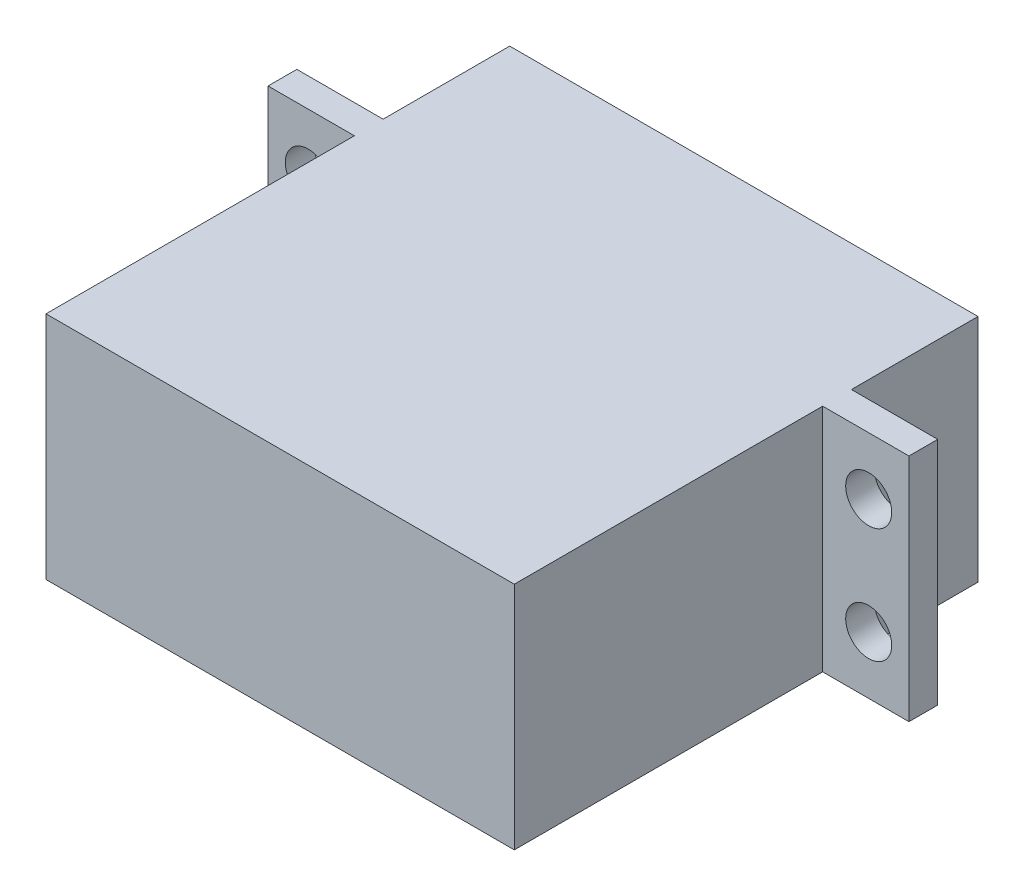
ISO-10303-21;
HEADER;
FILE_DESCRIPTION(('STEP AP214'),'2;1');
FILE_NAME('part.step','',(''),(''),'','','');
FILE_SCHEMA(('AUTOMOTIVE_DESIGN { 1 0 10303 214 1 1 1 1 }'));
ENDSEC;
DATA;
#1=APPLICATION_CONTEXT('core data for automotive mechanical design processes');
#2=APPLICATION_PROTOCOL_DEFINITION('international standard','automotive_design',2000,#1);
#3=PRODUCT_CONTEXT('',#1,'mechanical');
#4=PRODUCT('Part','Part','',(#3));
#5=PRODUCT_RELATED_PRODUCT_CATEGORY('part','',(#4));
#6=PRODUCT_DEFINITION_FORMATION('','',#4);
#7=PRODUCT_DEFINITION_CONTEXT('part definition',#1,'design');
#8=PRODUCT_DEFINITION('design','',#6,#7);
#9=PRODUCT_DEFINITION_SHAPE('','',#8);
#10=(LENGTH_UNIT() NAMED_UNIT(*) SI_UNIT(.MILLI.,.METRE.));
#11=(NAMED_UNIT(*) PLANE_ANGLE_UNIT() SI_UNIT($,.RADIAN.));
#12=(NAMED_UNIT(*) SI_UNIT($,.STERADIAN.) SOLID_ANGLE_UNIT());
#13=UNCERTAINTY_MEASURE_WITH_UNIT(LENGTH_MEASURE(1.E-05),#10,'distance_accuracy_value','');
#14=(GEOMETRIC_REPRESENTATION_CONTEXT(3) GLOBAL_UNCERTAINTY_ASSIGNED_CONTEXT((#13)) GLOBAL_UNIT_ASSIGNED_CONTEXT((#10,
#11,#12)) REPRESENTATION_CONTEXT('',''));
#15=CARTESIAN_POINT('',(0.,0.,0.));
#16=DIRECTION('',(0.,0.,1.));
#17=DIRECTION('',(1.,0.,0.));
#18=AXIS2_PLACEMENT_3D('',#15,#16,#17);
#19=CARTESIAN_POINT('',(0.,0.,0.));
#20=DIRECTION('',(0.,0.,-1.));
#21=DIRECTION('',(-1.,0.,0.));
#22=AXIS2_PLACEMENT_3D('',#19,#20,#21);
#23=PLANE('',#22);
#24=DIRECTION('',(0.,1.,0.));
#25=VECTOR('',#24,1.);
#26=CARTESIAN_POINT('',(20.35,-10.,0.));
#27=LINE('',#26,#25);
#28=CARTESIAN_POINT('',(20.35,-10.,0.));
#29=VERTEX_POINT('',#28);
#30=CARTESIAN_POINT('',(20.35,10.,0.));
#31=VERTEX_POINT('',#30);
#32=EDGE_CURVE('E207',#29,#31,#27,.T.);
#33=ORIENTED_EDGE('',*,*,#32,.F.);
#34=DIRECTION('',(1.,0.,0.));
#35=VECTOR('',#34,1.);
#36=CARTESIAN_POINT('',(-20.35,-10.,0.));
#37=LINE('',#36,#35);
#38=CARTESIAN_POINT('',(-20.35,-10.,0.));
#39=VERTEX_POINT('',#38);
#40=EDGE_CURVE('E244',#39,#29,#37,.T.);
#41=ORIENTED_EDGE('',*,*,#40,.F.);
#42=DIRECTION('',(0.,-1.,0.));
#43=VECTOR('',#42,1.);
#44=CARTESIAN_POINT('',(-20.35,-10.,0.));
#45=LINE('',#44,#43);
#46=CARTESIAN_POINT('',(-20.35,10.,0.));
#47=VERTEX_POINT('',#46);
#48=EDGE_CURVE('E130',#47,#39,#45,.T.);
#49=ORIENTED_EDGE('',*,*,#48,.F.);
#50=DIRECTION('',(-1.,0.,0.));
#51=VECTOR('',#50,1.);
#52=CARTESIAN_POINT('',(-20.35,10.,0.));
#53=LINE('',#52,#51);
#54=EDGE_CURVE('E237',#31,#47,#53,.T.);
#55=ORIENTED_EDGE('',*,*,#54,.F.);
#56=EDGE_LOOP('',(#33,#41,#49,#55));
#57=FACE_BOUND('',#56,.T.);
#58=CARTESIAN_POINT('',(10.35,0.,0.));
#59=DIRECTION('',(0.,0.,-1.));
#60=DIRECTION('',(-1.,0.,0.));
#61=AXIS2_PLACEMENT_3D('',#58,#59,#60);
#62=CIRCLE('',#61,3.);
#63=CARTESIAN_POINT('',(7.34999999999999,0.,0.));
#64=VERTEX_POINT('',#63);
#65=EDGE_CURVE('E484',#64,#64,#62,.T.);
#66=ORIENTED_EDGE('',*,*,#65,.F.);
#67=EDGE_LOOP('',(#66));
#68=FACE_BOUND('',#67,.T.);
#69=ADVANCED_FACE('F36',(#57,#68),#23,.T.);
#70=CARTESIAN_POINT('',(-20.35,-10.,40.3));
#71=DIRECTION('',(1.,0.,0.));
#72=DIRECTION('',(0.,0.,-1.));
#73=AXIS2_PLACEMENT_3D('',#70,#71,#72);
#74=PLANE('',#73);
#75=DIRECTION('',(0.,-1.,0.));
#76=VECTOR('',#75,1.);
#77=CARTESIAN_POINT('',(-20.35,0.,11.));
#78=LINE('',#77,#76);
#79=CARTESIAN_POINT('',(-20.35,10.,11.));
#80=VERTEX_POINT('',#79);
#81=CARTESIAN_POINT('',(-20.35,-10.,11.));
#82=VERTEX_POINT('',#81);
#83=EDGE_CURVE('E53',#80,#82,#78,.T.);
#84=ORIENTED_EDGE('',*,*,#83,.F.);
#85=DIRECTION('',(0.,0.,-1.));
#86=VECTOR('',#85,1.);
#87=CARTESIAN_POINT('',(-20.35,10.,40.3));
#88=LINE('',#87,#86);
#89=EDGE_CURVE('E221',#80,#47,#88,.T.);
#90=ORIENTED_EDGE('',*,*,#89,.T.);
#91=ORIENTED_EDGE('',*,*,#48,.T.);
#92=DIRECTION('',(0.,0.,-1.));
#93=VECTOR('',#92,1.);
#94=CARTESIAN_POINT('',(-20.35,-10.,40.3));
#95=LINE('',#94,#93);
#96=EDGE_CURVE('E126',#82,#39,#95,.T.);
#97=ORIENTED_EDGE('',*,*,#96,.F.);
#98=EDGE_LOOP('',(#84,#90,#91,#97));
#99=FACE_BOUND('',#98,.T.);
#100=ADVANCED_FACE('F128',(#99),#74,.F.);
#101=CARTESIAN_POINT('',(20.35,-10.,40.3));
#102=DIRECTION('',(-1.,0.,0.));
#103=DIRECTION('',(0.,0.,1.));
#104=AXIS2_PLACEMENT_3D('',#101,#102,#103);
#105=PLANE('',#104);
#106=DIRECTION('',(0.,-1.,0.));
#107=VECTOR('',#106,1.);
#108=CARTESIAN_POINT('',(20.35,0.,13.5));
#109=LINE('',#108,#107);
#110=CARTESIAN_POINT('',(20.35,10.,13.5));
#111=VERTEX_POINT('',#110);
#112=CARTESIAN_POINT('',(20.35,-10.,13.5));
#113=VERTEX_POINT('',#112);
#114=EDGE_CURVE('E190',#111,#113,#109,.T.);
#115=ORIENTED_EDGE('',*,*,#114,.F.);
#116=DIRECTION('',(0.,0.,-1.));
#117=VECTOR('',#116,1.);
#118=CARTESIAN_POINT('',(20.35,10.,40.3));
#119=LINE('',#118,#117);
#120=CARTESIAN_POINT('',(20.35,10.,40.3));
#121=VERTEX_POINT('',#120);
#122=EDGE_CURVE('E11',#121,#111,#119,.T.);
#123=ORIENTED_EDGE('',*,*,#122,.F.);
#124=DIRECTION('',(0.,1.,0.));
#125=VECTOR('',#124,1.);
#126=CARTESIAN_POINT('',(20.35,-10.,40.3));
#127=LINE('',#126,#125);
#128=CARTESIAN_POINT('',(20.35,-10.,40.3));
#129=VERTEX_POINT('',#128);
#130=EDGE_CURVE('E246',#129,#121,#127,.T.);
#131=ORIENTED_EDGE('',*,*,#130,.F.);
#132=DIRECTION('',(0.,0.,-1.));
#133=VECTOR('',#132,1.);
#134=CARTESIAN_POINT('',(20.35,-10.,40.3));
#135=LINE('',#134,#133);
#136=EDGE_CURVE('E135',#129,#113,#135,.T.);
#137=ORIENTED_EDGE('',*,*,#136,.T.);
#138=EDGE_LOOP('',(#115,#123,#131,#137));
#139=FACE_BOUND('',#138,.T.);
#140=ADVANCED_FACE('F262',(#139),#105,.F.);
#141=CARTESIAN_POINT('',(20.35,10.,11.));
#142=VERTEX_POINT('',#141);
#143=EDGE_CURVE('E45',#142,#31,#119,.T.);
#144=ORIENTED_EDGE('',*,*,#143,.F.);
#145=DIRECTION('',(0.,-1.,0.));
#146=VECTOR('',#145,1.);
#147=CARTESIAN_POINT('',(20.35,0.,11.));
#148=LINE('',#147,#146);
#149=CARTESIAN_POINT('',(20.35,-10.,11.));
#150=VERTEX_POINT('',#149);
#151=EDGE_CURVE('E177',#142,#150,#148,.T.);
#152=ORIENTED_EDGE('',*,*,#151,.T.);
#153=EDGE_CURVE('E195',#150,#29,#135,.T.);
#154=ORIENTED_EDGE('',*,*,#153,.T.);
#155=ORIENTED_EDGE('',*,*,#32,.T.);
#156=EDGE_LOOP('',(#144,#152,#154,#155));
#157=FACE_BOUND('',#156,.T.);
#158=ADVANCED_FACE('F38',(#157),#105,.F.);
#159=CARTESIAN_POINT('',(-20.35,10.,40.3));
#160=DIRECTION('',(0.,-1.,0.));
#161=DIRECTION('',(0.,0.,-1.));
#162=AXIS2_PLACEMENT_3D('',#159,#160,#161);
#163=PLANE('',#162);
#164=ORIENTED_EDGE('',*,*,#54,.T.);
#165=ORIENTED_EDGE('',*,*,#89,.F.);
#166=DIRECTION('',(-1.,0.,0.));
#167=VECTOR('',#166,1.);
#168=CARTESIAN_POINT('',(-20.35,10.,11.));
#169=LINE('',#168,#167);
#170=CARTESIAN_POINT('',(-27.85,10.,11.));
#171=VERTEX_POINT('',#170);
#172=EDGE_CURVE('E147',#80,#171,#169,.T.);
#173=ORIENTED_EDGE('',*,*,#172,.T.);
#174=DIRECTION('',(0.,0.,1.));
#175=VECTOR('',#174,1.);
#176=CARTESIAN_POINT('',(-27.85,10.,0.));
#177=LINE('',#176,#175);
#178=CARTESIAN_POINT('',(-27.85,10.,13.5));
#179=VERTEX_POINT('',#178);
#180=EDGE_CURVE('E165',#171,#179,#177,.T.);
#181=ORIENTED_EDGE('',*,*,#180,.T.);
#182=DIRECTION('',(-1.,0.,0.));
#183=VECTOR('',#182,1.);
#184=CARTESIAN_POINT('',(-20.35,10.,13.5));
#185=LINE('',#184,#183);
#186=CARTESIAN_POINT('',(-20.35,10.,13.5));
#187=VERTEX_POINT('',#186);
#188=EDGE_CURVE('E194',#187,#179,#185,.T.);
#189=ORIENTED_EDGE('',*,*,#188,.F.);
#190=CARTESIAN_POINT('',(-20.35,10.,40.3));
#191=VERTEX_POINT('',#190);
#192=EDGE_CURVE('E61',#191,#187,#88,.T.);
#193=ORIENTED_EDGE('',*,*,#192,.F.);
#194=DIRECTION('',(-1.,0.,0.));
#195=VECTOR('',#194,1.);
#196=CARTESIAN_POINT('',(-20.35,10.,40.3));
#197=LINE('',#196,#195);
#198=EDGE_CURVE('E253',#121,#191,#197,.T.);
#199=ORIENTED_EDGE('',*,*,#198,.F.);
#200=ORIENTED_EDGE('',*,*,#122,.T.);
#201=DIRECTION('',(-1.,0.,0.));
#202=VECTOR('',#201,1.);
#203=CARTESIAN_POINT('',(27.85,10.,13.5));
#204=LINE('',#203,#202);
#205=CARTESIAN_POINT('',(27.85,10.,13.5));
#206=VERTEX_POINT('',#205);
#207=EDGE_CURVE('E201',#206,#111,#204,.T.);
#208=ORIENTED_EDGE('',*,*,#207,.F.);
#209=DIRECTION('',(0.,0.,1.));
#210=VECTOR('',#209,1.);
#211=CARTESIAN_POINT('',(27.85,10.,0.));
#212=LINE('',#211,#210);
#213=CARTESIAN_POINT('',(27.85,10.,11.));
#214=VERTEX_POINT('',#213);
#215=EDGE_CURVE('E173',#214,#206,#212,.T.);
#216=ORIENTED_EDGE('',*,*,#215,.F.);
#217=DIRECTION('',(-1.,0.,0.));
#218=VECTOR('',#217,1.);
#219=CARTESIAN_POINT('',(27.85,10.,11.));
#220=LINE('',#219,#218);
#221=EDGE_CURVE('E184',#214,#142,#220,.T.);
#222=ORIENTED_EDGE('',*,*,#221,.T.);
#223=ORIENTED_EDGE('',*,*,#143,.T.);
#224=EDGE_LOOP('',(#164,#165,#173,#181,#189,#193,#199,#200,#208,#216,#222,#223));
#225=FACE_BOUND('',#224,.T.);
#226=ADVANCED_FACE('F238',(#225),#163,.F.);
#227=ORIENTED_EDGE('',*,*,#192,.T.);
#228=DIRECTION('',(0.,-1.,0.));
#229=VECTOR('',#228,1.);
#230=CARTESIAN_POINT('',(-20.35,0.,13.5));
#231=LINE('',#230,#229);
#232=CARTESIAN_POINT('',(-20.35,-10.,13.5));
#233=VERTEX_POINT('',#232);
#234=EDGE_CURVE('E151',#187,#233,#231,.T.);
#235=ORIENTED_EDGE('',*,*,#234,.T.);
#236=CARTESIAN_POINT('',(-20.35,-10.,40.3));
#237=VERTEX_POINT('',#236);
#238=EDGE_CURVE('E134',#237,#233,#95,.T.);
#239=ORIENTED_EDGE('',*,*,#238,.F.);
#240=DIRECTION('',(0.,-1.,0.));
#241=VECTOR('',#240,1.);
#242=CARTESIAN_POINT('',(-20.35,-10.,40.3));
#243=LINE('',#242,#241);
#244=EDGE_CURVE('E251',#191,#237,#243,.T.);
#245=ORIENTED_EDGE('',*,*,#244,.F.);
#246=EDGE_LOOP('',(#227,#235,#239,#245));
#247=FACE_BOUND('',#246,.T.);
#248=ADVANCED_FACE('F309',(#247),#74,.F.);
#249=CARTESIAN_POINT('',(-20.35,-10.,40.3));
#250=DIRECTION('',(0.,1.,0.));
#251=DIRECTION('',(0.,0.,1.));
#252=AXIS2_PLACEMENT_3D('',#249,#250,#251);
#253=PLANE('',#252);
#254=ORIENTED_EDGE('',*,*,#40,.T.);
#255=ORIENTED_EDGE('',*,*,#153,.F.);
#256=DIRECTION('',(-1.,0.,0.));
#257=VECTOR('',#256,1.);
#258=CARTESIAN_POINT('',(27.85,-10.,11.));
#259=LINE('',#258,#257);
#260=CARTESIAN_POINT('',(27.85,-10.,11.));
#261=VERTEX_POINT('',#260);
#262=EDGE_CURVE('E202',#261,#150,#259,.T.);
#263=ORIENTED_EDGE('',*,*,#262,.F.);
#264=DIRECTION('',(0.,0.,-1.));
#265=VECTOR('',#264,1.);
#266=CARTESIAN_POINT('',(27.85,-10.,0.));
#267=LINE('',#266,#265);
#268=CARTESIAN_POINT('',(27.85,-10.,13.5));
#269=VERTEX_POINT('',#268);
#270=EDGE_CURVE('E179',#269,#261,#267,.T.);
#271=ORIENTED_EDGE('',*,*,#270,.F.);
#272=DIRECTION('',(-1.,0.,0.));
#273=VECTOR('',#272,1.);
#274=CARTESIAN_POINT('',(27.85,-10.,13.5));
#275=LINE('',#274,#273);
#276=EDGE_CURVE('E198',#269,#113,#275,.T.);
#277=ORIENTED_EDGE('',*,*,#276,.T.);
#278=ORIENTED_EDGE('',*,*,#136,.F.);
#279=DIRECTION('',(1.,0.,0.));
#280=VECTOR('',#279,1.);
#281=CARTESIAN_POINT('',(-20.35,-10.,40.3));
#282=LINE('',#281,#280);
#283=EDGE_CURVE('E249',#237,#129,#282,.T.);
#284=ORIENTED_EDGE('',*,*,#283,.F.);
#285=ORIENTED_EDGE('',*,*,#238,.T.);
#286=DIRECTION('',(-1.,0.,0.));
#287=VECTOR('',#286,1.);
#288=CARTESIAN_POINT('',(-20.35,-10.,13.5));
#289=LINE('',#288,#287);
#290=CARTESIAN_POINT('',(-27.85,-10.,13.5));
#291=VERTEX_POINT('',#290);
#292=EDGE_CURVE('E146',#233,#291,#289,.T.);
#293=ORIENTED_EDGE('',*,*,#292,.T.);
#294=DIRECTION('',(0.,0.,-1.));
#295=VECTOR('',#294,1.);
#296=CARTESIAN_POINT('',(-27.85,-10.,0.));
#297=LINE('',#296,#295);
#298=CARTESIAN_POINT('',(-27.85,-10.,11.));
#299=VERTEX_POINT('',#298);
#300=EDGE_CURVE('E142',#291,#299,#297,.T.);
#301=ORIENTED_EDGE('',*,*,#300,.T.);
#302=DIRECTION('',(-1.,0.,0.));
#303=VECTOR('',#302,1.);
#304=CARTESIAN_POINT('',(-20.35,-10.,11.));
#305=LINE('',#304,#303);
#306=EDGE_CURVE('E138',#82,#299,#305,.T.);
#307=ORIENTED_EDGE('',*,*,#306,.F.);
#308=ORIENTED_EDGE('',*,*,#96,.T.);
#309=EDGE_LOOP('',(#254,#255,#263,#271,#277,#278,#284,#285,#293,#301,#307,#308));
#310=FACE_BOUND('',#309,.T.);
#311=ADVANCED_FACE('F139',(#310),#253,.F.);
#312=CARTESIAN_POINT('',(0.,0.,40.3));
#313=DIRECTION('',(0.,0.,-1.));
#314=DIRECTION('',(-1.,0.,0.));
#315=AXIS2_PLACEMENT_3D('',#312,#313,#314);
#316=PLANE('',#315);
#317=ORIENTED_EDGE('',*,*,#130,.T.);
#318=ORIENTED_EDGE('',*,*,#198,.T.);
#319=ORIENTED_EDGE('',*,*,#244,.T.);
#320=ORIENTED_EDGE('',*,*,#283,.T.);
#321=EDGE_LOOP('',(#317,#318,#319,#320));
#322=FACE_BOUND('',#321,.T.);
#323=ADVANCED_FACE('F258',(#322),#316,.F.);
#324=CARTESIAN_POINT('',(27.85,0.,13.5));
#325=DIRECTION('',(0.,0.,-1.));
#326=DIRECTION('',(0.,1.,0.));
#327=AXIS2_PLACEMENT_3D('',#324,#325,#326);
#328=PLANE('',#327);
#329=CARTESIAN_POINT('',(24.35,-5.,13.5));
#330=DIRECTION('',(0.,0.,-1.));
#331=DIRECTION('',(0.,1.,0.));
#332=AXIS2_PLACEMENT_3D('',#329,#330,#331);
#333=CIRCLE('',#332,2.);
#334=CARTESIAN_POINT('',(24.35,-3.,13.5));
#335=VERTEX_POINT('',#334);
#336=EDGE_CURVE('E475',#335,#335,#333,.T.);
#337=ORIENTED_EDGE('',*,*,#336,.T.);
#338=EDGE_LOOP('',(#337));
#339=FACE_BOUND('',#338,.T.);
#340=CARTESIAN_POINT('',(24.35,5.,13.5));
#341=DIRECTION('',(0.,0.,-1.));
#342=DIRECTION('',(0.,1.,0.));
#343=AXIS2_PLACEMENT_3D('',#340,#341,#342);
#344=CIRCLE('',#343,2.);
#345=CARTESIAN_POINT('',(24.35,7.,13.5));
#346=VERTEX_POINT('',#345);
#347=EDGE_CURVE('E481',#346,#346,#344,.T.);
#348=ORIENTED_EDGE('',*,*,#347,.T.);
#349=EDGE_LOOP('',(#348));
#350=FACE_BOUND('',#349,.T.);
#351=ORIENTED_EDGE('',*,*,#114,.T.);
#352=ORIENTED_EDGE('',*,*,#276,.F.);
#353=DIRECTION('',(0.,-1.,0.));
#354=VECTOR('',#353,1.);
#355=CARTESIAN_POINT('',(27.85,0.,13.5));
#356=LINE('',#355,#354);
#357=EDGE_CURVE('E176',#206,#269,#356,.T.);
#358=ORIENTED_EDGE('',*,*,#357,.F.);
#359=ORIENTED_EDGE('',*,*,#207,.T.);
#360=EDGE_LOOP('',(#351,#352,#358,#359));
#361=FACE_BOUND('',#360,.T.);
#362=ADVANCED_FACE('F266',(#339,#350,#361),#328,.F.);
#363=CARTESIAN_POINT('',(27.85,0.,11.));
#364=DIRECTION('',(0.,0.,-1.));
#365=DIRECTION('',(0.,1.,0.));
#366=AXIS2_PLACEMENT_3D('',#363,#364,#365);
#367=PLANE('',#366);
#368=CARTESIAN_POINT('',(24.35,-5.,11.));
#369=DIRECTION('',(0.,0.,-1.));
#370=DIRECTION('',(0.,1.,0.));
#371=AXIS2_PLACEMENT_3D('',#368,#369,#370);
#372=CIRCLE('',#371,2.);
#373=CARTESIAN_POINT('',(24.35,-3.,11.));
#374=VERTEX_POINT('',#373);
#375=EDGE_CURVE('E472',#374,#374,#372,.T.);
#376=ORIENTED_EDGE('',*,*,#375,.F.);
#377=EDGE_LOOP('',(#376));
#378=FACE_BOUND('',#377,.T.);
#379=CARTESIAN_POINT('',(24.35,5.,11.));
#380=DIRECTION('',(0.,0.,-1.));
#381=DIRECTION('',(0.,1.,0.));
#382=AXIS2_PLACEMENT_3D('',#379,#380,#381);
#383=CIRCLE('',#382,2.);
#384=CARTESIAN_POINT('',(24.35,7.,11.));
#385=VERTEX_POINT('',#384);
#386=EDGE_CURVE('E478',#385,#385,#383,.T.);
#387=ORIENTED_EDGE('',*,*,#386,.F.);
#388=EDGE_LOOP('',(#387));
#389=FACE_BOUND('',#388,.T.);
#390=ORIENTED_EDGE('',*,*,#151,.F.);
#391=ORIENTED_EDGE('',*,*,#221,.F.);
#392=DIRECTION('',(0.,-1.,0.));
#393=VECTOR('',#392,1.);
#394=CARTESIAN_POINT('',(27.85,0.,11.));
#395=LINE('',#394,#393);
#396=EDGE_CURVE('E181',#214,#261,#395,.T.);
#397=ORIENTED_EDGE('',*,*,#396,.T.);
#398=ORIENTED_EDGE('',*,*,#262,.T.);
#399=EDGE_LOOP('',(#390,#391,#397,#398));
#400=FACE_BOUND('',#399,.T.);
#401=ADVANCED_FACE('F274',(#378,#389,#400),#367,.T.);
#402=CARTESIAN_POINT('',(27.85,0.,0.));
#403=DIRECTION('',(1.,0.,0.));
#404=DIRECTION('',(0.,0.,-1.));
#405=AXIS2_PLACEMENT_3D('',#402,#403,#404);
#406=PLANE('',#405);
#407=ORIENTED_EDGE('',*,*,#215,.T.);
#408=ORIENTED_EDGE('',*,*,#357,.T.);
#409=ORIENTED_EDGE('',*,*,#270,.T.);
#410=ORIENTED_EDGE('',*,*,#396,.F.);
#411=EDGE_LOOP('',(#407,#408,#409,#410));
#412=FACE_BOUND('',#411,.T.);
#413=ADVANCED_FACE('F271',(#412),#406,.T.);
#414=CARTESIAN_POINT('',(-20.35,0.,13.5));
#415=DIRECTION('',(0.,0.,-1.));
#416=DIRECTION('',(0.,1.,0.));
#417=AXIS2_PLACEMENT_3D('',#414,#415,#416);
#418=PLANE('',#417);
#419=CARTESIAN_POINT('',(-24.35,-5.,13.5));
#420=DIRECTION('',(0.,0.,-1.));
#421=DIRECTION('',(0.,1.,0.));
#422=AXIS2_PLACEMENT_3D('',#419,#420,#421);
#423=CIRCLE('',#422,2.);
#424=CARTESIAN_POINT('',(-24.35,-3.,13.5));
#425=VERTEX_POINT('',#424);
#426=EDGE_CURVE('E462',#425,#425,#423,.T.);
#427=ORIENTED_EDGE('',*,*,#426,.T.);
#428=EDGE_LOOP('',(#427));
#429=FACE_BOUND('',#428,.T.);
#430=CARTESIAN_POINT('',(-24.35,5.,13.5));
#431=DIRECTION('',(0.,0.,-1.));
#432=DIRECTION('',(0.,1.,0.));
#433=AXIS2_PLACEMENT_3D('',#430,#431,#432);
#434=CIRCLE('',#433,2.);
#435=CARTESIAN_POINT('',(-24.35,7.,13.5));
#436=VERTEX_POINT('',#435);
#437=EDGE_CURVE('E466',#436,#436,#434,.T.);
#438=ORIENTED_EDGE('',*,*,#437,.T.);
#439=EDGE_LOOP('',(#438));
#440=FACE_BOUND('',#439,.T.);
#441=DIRECTION('',(0.,-1.,0.));
#442=VECTOR('',#441,1.);
#443=CARTESIAN_POINT('',(-27.85,0.,13.5));
#444=LINE('',#443,#442);
#445=EDGE_CURVE('E168',#179,#291,#444,.T.);
#446=ORIENTED_EDGE('',*,*,#445,.T.);
#447=ORIENTED_EDGE('',*,*,#292,.F.);
#448=ORIENTED_EDGE('',*,*,#234,.F.);
#449=ORIENTED_EDGE('',*,*,#188,.T.);
#450=EDGE_LOOP('',(#446,#447,#448,#449));
#451=FACE_BOUND('',#450,.T.);
#452=ADVANCED_FACE('F281',(#429,#440,#451),#418,.F.);
#453=CARTESIAN_POINT('',(-20.35,0.,11.));
#454=DIRECTION('',(0.,0.,-1.));
#455=DIRECTION('',(0.,1.,0.));
#456=AXIS2_PLACEMENT_3D('',#453,#454,#455);
#457=PLANE('',#456);
#458=CARTESIAN_POINT('',(-24.35,-5.,11.));
#459=DIRECTION('',(0.,0.,-1.));
#460=DIRECTION('',(0.,1.,0.));
#461=AXIS2_PLACEMENT_3D('',#458,#459,#460);
#462=CIRCLE('',#461,2.);
#463=CARTESIAN_POINT('',(-24.35,-3.,11.));
#464=VERTEX_POINT('',#463);
#465=EDGE_CURVE('E459',#464,#464,#462,.T.);
#466=ORIENTED_EDGE('',*,*,#465,.F.);
#467=EDGE_LOOP('',(#466));
#468=FACE_BOUND('',#467,.T.);
#469=CARTESIAN_POINT('',(-24.35,5.,11.));
#470=DIRECTION('',(0.,0.,-1.));
#471=DIRECTION('',(0.,1.,0.));
#472=AXIS2_PLACEMENT_3D('',#469,#470,#471);
#473=CIRCLE('',#472,2.);
#474=CARTESIAN_POINT('',(-24.35,7.,11.));
#475=VERTEX_POINT('',#474);
#476=EDGE_CURVE('E463',#475,#475,#473,.T.);
#477=ORIENTED_EDGE('',*,*,#476,.F.);
#478=EDGE_LOOP('',(#477));
#479=FACE_BOUND('',#478,.T.);
#480=DIRECTION('',(0.,-1.,0.));
#481=VECTOR('',#480,1.);
#482=CARTESIAN_POINT('',(-27.85,0.,11.));
#483=LINE('',#482,#481);
#484=EDGE_CURVE('E154',#171,#299,#483,.T.);
#485=ORIENTED_EDGE('',*,*,#484,.F.);
#486=ORIENTED_EDGE('',*,*,#172,.F.);
#487=ORIENTED_EDGE('',*,*,#83,.T.);
#488=ORIENTED_EDGE('',*,*,#306,.T.);
#489=EDGE_LOOP('',(#485,#486,#487,#488));
#490=FACE_BOUND('',#489,.T.);
#491=ADVANCED_FACE('F150',(#468,#479,#490),#457,.T.);
#492=CARTESIAN_POINT('',(-27.85,0.,0.));
#493=DIRECTION('',(1.,0.,0.));
#494=DIRECTION('',(0.,0.,-1.));
#495=AXIS2_PLACEMENT_3D('',#492,#493,#494);
#496=PLANE('',#495);
#497=ORIENTED_EDGE('',*,*,#180,.F.);
#498=ORIENTED_EDGE('',*,*,#484,.T.);
#499=ORIENTED_EDGE('',*,*,#300,.F.);
#500=ORIENTED_EDGE('',*,*,#445,.F.);
#501=EDGE_LOOP('',(#497,#498,#499,#500));
#502=FACE_BOUND('',#501,.T.);
#503=ADVANCED_FACE('F290',(#502),#496,.F.);
#504=CARTESIAN_POINT('',(10.35,0.,-4.));
#505=DIRECTION('',(0.,0.,1.));
#506=DIRECTION('',(1.,0.,0.));
#507=AXIS2_PLACEMENT_3D('',#504,#505,#506);
#508=CYLINDRICAL_SURFACE('',#507,3.);
#509=CARTESIAN_POINT('',(10.35,0.,-4.));
#510=DIRECTION('',(0.,0.,-1.));
#511=DIRECTION('',(-1.,0.,0.));
#512=AXIS2_PLACEMENT_3D('',#509,#510,#511);
#513=CIRCLE('',#512,3.);
#514=CARTESIAN_POINT('',(7.34999999999999,0.,-4.));
#515=VERTEX_POINT('',#514);
#516=EDGE_CURVE('E169',#515,#515,#513,.T.);
#517=ORIENTED_EDGE('',*,*,#516,.F.);
#518=EDGE_LOOP('',(#517));
#519=FACE_BOUND('',#518,.T.);
#520=ORIENTED_EDGE('',*,*,#65,.T.);
#521=EDGE_LOOP('',(#520));
#522=FACE_BOUND('',#521,.T.);
#523=ADVANCED_FACE('F292',(#519,#522),#508,.T.);
#524=CARTESIAN_POINT('',(10.35,0.,-4.));
#525=DIRECTION('',(0.,0.,-1.));
#526=DIRECTION('',(-1.,0.,0.));
#527=AXIS2_PLACEMENT_3D('',#524,#525,#526);
#528=PLANE('',#527);
#529=ORIENTED_EDGE('',*,*,#516,.T.);
#530=EDGE_LOOP('',(#529));
#531=FACE_BOUND('',#530,.T.);
#532=ADVANCED_FACE('F298',(#531),#528,.T.);
#533=CARTESIAN_POINT('',(24.35,5.,21.));
#534=DIRECTION('',(0.,0.,-1.));
#535=DIRECTION('',(0.,1.,0.));
#536=AXIS2_PLACEMENT_3D('',#533,#534,#535);
#537=CYLINDRICAL_SURFACE('',#536,2.);
#538=ORIENTED_EDGE('',*,*,#386,.T.);
#539=EDGE_LOOP('',(#538));
#540=FACE_BOUND('',#539,.T.);
#541=ORIENTED_EDGE('',*,*,#347,.F.);
#542=EDGE_LOOP('',(#541));
#543=FACE_BOUND('',#542,.T.);
#544=ADVANCED_FACE('F379',(#540,#543),#537,.F.);
#545=CARTESIAN_POINT('',(24.35,-5.,21.));
#546=DIRECTION('',(0.,0.,-1.));
#547=DIRECTION('',(0.,1.,0.));
#548=AXIS2_PLACEMENT_3D('',#545,#546,#547);
#549=CYLINDRICAL_SURFACE('',#548,2.);
#550=ORIENTED_EDGE('',*,*,#375,.T.);
#551=EDGE_LOOP('',(#550));
#552=FACE_BOUND('',#551,.T.);
#553=ORIENTED_EDGE('',*,*,#336,.F.);
#554=EDGE_LOOP('',(#553));
#555=FACE_BOUND('',#554,.T.);
#556=ADVANCED_FACE('F422',(#552,#555),#549,.F.);
#557=CARTESIAN_POINT('',(-24.35,5.,21.));
#558=DIRECTION('',(0.,0.,-1.));
#559=DIRECTION('',(0.,1.,0.));
#560=AXIS2_PLACEMENT_3D('',#557,#558,#559);
#561=CYLINDRICAL_SURFACE('',#560,2.);
#562=ORIENTED_EDGE('',*,*,#476,.T.);
#563=EDGE_LOOP('',(#562));
#564=FACE_BOUND('',#563,.T.);
#565=ORIENTED_EDGE('',*,*,#437,.F.);
#566=EDGE_LOOP('',(#565));
#567=FACE_BOUND('',#566,.T.);
#568=ADVANCED_FACE('F432',(#564,#567),#561,.F.);
#569=CARTESIAN_POINT('',(-24.35,-5.,21.));
#570=DIRECTION('',(0.,0.,-1.));
#571=DIRECTION('',(0.,1.,0.));
#572=AXIS2_PLACEMENT_3D('',#569,#570,#571);
#573=CYLINDRICAL_SURFACE('',#572,2.);
#574=ORIENTED_EDGE('',*,*,#465,.T.);
#575=EDGE_LOOP('',(#574));
#576=FACE_BOUND('',#575,.T.);
#577=ORIENTED_EDGE('',*,*,#426,.F.);
#578=EDGE_LOOP('',(#577));
#579=FACE_BOUND('',#578,.T.);
#580=ADVANCED_FACE('F442',(#576,#579),#573,.F.);
#581=CLOSED_SHELL('',(#69,#100,#140,#158,#226,#248,#311,#323,#362,#401,#413,#452,#491,#503,#523,
#532,#544,#556,#568,#580));
#582=MANIFOLD_SOLID_BREP('B2',#581);
#583=ADVANCED_BREP_SHAPE_REPRESENTATION('',(#18,#582),#14);
#584=SHAPE_DEFINITION_REPRESENTATION(#9,#583);
ENDSEC;
END-ISO-10303-21;
